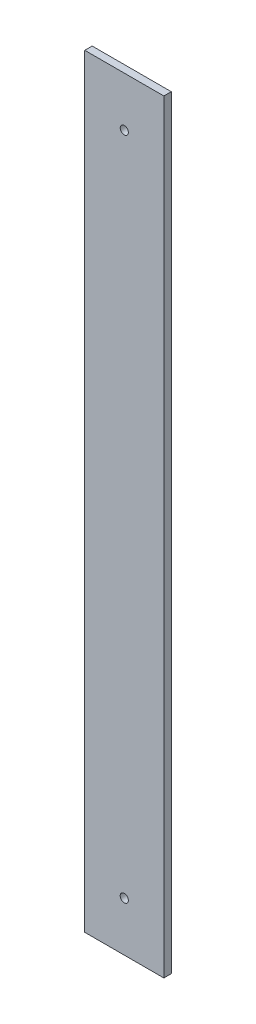
ISO-10303-21;
HEADER;
FILE_DESCRIPTION(('STEP AP214'),'2;1');
FILE_NAME('part.step','',(''),(''),'','','');
FILE_SCHEMA(('AUTOMOTIVE_DESIGN { 1 0 10303 214 1 1 1 1 }'));
ENDSEC;
DATA;
#1=APPLICATION_CONTEXT('core data for automotive mechanical design processes');
#2=APPLICATION_PROTOCOL_DEFINITION('international standard','automotive_design',2000,#1);
#3=PRODUCT_CONTEXT('',#1,'mechanical');
#4=PRODUCT('Part','Part','',(#3));
#5=PRODUCT_RELATED_PRODUCT_CATEGORY('part','',(#4));
#6=PRODUCT_DEFINITION_FORMATION('','',#4);
#7=PRODUCT_DEFINITION_CONTEXT('part definition',#1,'design');
#8=PRODUCT_DEFINITION('design','',#6,#7);
#9=PRODUCT_DEFINITION_SHAPE('','',#8);
#10=(LENGTH_UNIT() NAMED_UNIT(*) SI_UNIT(.MILLI.,.METRE.));
#11=(NAMED_UNIT(*) PLANE_ANGLE_UNIT() SI_UNIT($,.RADIAN.));
#12=(NAMED_UNIT(*) SI_UNIT($,.STERADIAN.) SOLID_ANGLE_UNIT());
#13=UNCERTAINTY_MEASURE_WITH_UNIT(LENGTH_MEASURE(1.E-05),#10,'distance_accuracy_value','');
#14=(GEOMETRIC_REPRESENTATION_CONTEXT(3) GLOBAL_UNCERTAINTY_ASSIGNED_CONTEXT((#13)) GLOBAL_UNIT_ASSIGNED_CONTEXT((#10,
#11,#12)) REPRESENTATION_CONTEXT('',''));
#15=CARTESIAN_POINT('',(0.,0.,0.));
#16=DIRECTION('',(0.,0.,1.));
#17=DIRECTION('',(1.,0.,0.));
#18=AXIS2_PLACEMENT_3D('',#15,#16,#17);
#19=CARTESIAN_POINT('',(0.,0.,3.));
#20=DIRECTION('',(1.,0.,0.));
#21=DIRECTION('',(0.,0.,-1.));
#22=AXIS2_PLACEMENT_3D('',#19,#20,#21);
#23=PLANE('',#22);
#24=DIRECTION('',(0.,-1.,0.));
#25=VECTOR('',#24,1.);
#26=CARTESIAN_POINT('',(0.,0.,0.));
#27=LINE('',#26,#25);
#28=CARTESIAN_POINT('',(0.,309.,0.));
#29=VERTEX_POINT('',#28);
#30=CARTESIAN_POINT('',(0.,0.,0.));
#31=VERTEX_POINT('',#30);
#32=EDGE_CURVE('E97',#29,#31,#27,.T.);
#33=ORIENTED_EDGE('',*,*,#32,.T.);
#34=DIRECTION('',(0.,0.,-1.));
#35=VECTOR('',#34,1.);
#36=CARTESIAN_POINT('',(0.,0.,3.));
#37=LINE('',#36,#35);
#38=CARTESIAN_POINT('',(0.,0.,3.));
#39=VERTEX_POINT('',#38);
#40=EDGE_CURVE('E11',#39,#31,#37,.T.);
#41=ORIENTED_EDGE('',*,*,#40,.F.);
#42=DIRECTION('',(0.,-1.,0.));
#43=VECTOR('',#42,1.);
#44=CARTESIAN_POINT('',(0.,0.,3.));
#45=LINE('',#44,#43);
#46=CARTESIAN_POINT('',(0.,309.,3.));
#47=VERTEX_POINT('',#46);
#48=EDGE_CURVE('E85',#47,#39,#45,.T.);
#49=ORIENTED_EDGE('',*,*,#48,.F.);
#50=DIRECTION('',(0.,0.,-1.));
#51=VECTOR('',#50,1.);
#52=CARTESIAN_POINT('',(0.,309.,3.));
#53=LINE('',#52,#51);
#54=EDGE_CURVE('E93',#47,#29,#53,.T.);
#55=ORIENTED_EDGE('',*,*,#54,.T.);
#56=EDGE_LOOP('',(#33,#41,#49,#55));
#57=FACE_BOUND('',#56,.T.);
#58=ADVANCED_FACE('F34',(#57),#23,.F.);
#59=CARTESIAN_POINT('',(0.,0.,3.));
#60=DIRECTION('',(0.,1.,0.));
#61=DIRECTION('',(0.,0.,1.));
#62=AXIS2_PLACEMENT_3D('',#59,#60,#61);
#63=PLANE('',#62);
#64=DIRECTION('',(1.,0.,0.));
#65=VECTOR('',#64,1.);
#66=CARTESIAN_POINT('',(0.,0.,0.));
#67=LINE('',#66,#65);
#68=CARTESIAN_POINT('',(32.,0.,0.));
#69=VERTEX_POINT('',#68);
#70=EDGE_CURVE('E89',#31,#69,#67,.T.);
#71=ORIENTED_EDGE('',*,*,#70,.T.);
#72=DIRECTION('',(0.,0.,-1.));
#73=VECTOR('',#72,1.);
#74=CARTESIAN_POINT('',(32.,0.,3.));
#75=LINE('',#74,#73);
#76=CARTESIAN_POINT('',(32.,0.,3.));
#77=VERTEX_POINT('',#76);
#78=EDGE_CURVE('E42',#77,#69,#75,.T.);
#79=ORIENTED_EDGE('',*,*,#78,.F.);
#80=DIRECTION('',(1.,0.,0.));
#81=VECTOR('',#80,1.);
#82=CARTESIAN_POINT('',(0.,0.,3.));
#83=LINE('',#82,#81);
#84=EDGE_CURVE('E80',#39,#77,#83,.T.);
#85=ORIENTED_EDGE('',*,*,#84,.F.);
#86=ORIENTED_EDGE('',*,*,#40,.T.);
#87=EDGE_LOOP('',(#71,#79,#85,#86));
#88=FACE_BOUND('',#87,.T.);
#89=ADVANCED_FACE('F88',(#88),#63,.F.);
#90=CARTESIAN_POINT('',(32.,0.,3.));
#91=DIRECTION('',(-1.,0.,0.));
#92=DIRECTION('',(0.,0.,1.));
#93=AXIS2_PLACEMENT_3D('',#90,#91,#92);
#94=PLANE('',#93);
#95=DIRECTION('',(0.,1.,0.));
#96=VECTOR('',#95,1.);
#97=CARTESIAN_POINT('',(32.,0.,0.));
#98=LINE('',#97,#96);
#99=CARTESIAN_POINT('',(32.,309.,0.));
#100=VERTEX_POINT('',#99);
#101=EDGE_CURVE('E67',#69,#100,#98,.T.);
#102=ORIENTED_EDGE('',*,*,#101,.T.);
#103=DIRECTION('',(0.,0.,-1.));
#104=VECTOR('',#103,1.);
#105=CARTESIAN_POINT('',(32.,309.,3.));
#106=LINE('',#105,#104);
#107=CARTESIAN_POINT('',(32.,309.,3.));
#108=VERTEX_POINT('',#107);
#109=EDGE_CURVE('E90',#108,#100,#106,.T.);
#110=ORIENTED_EDGE('',*,*,#109,.F.);
#111=DIRECTION('',(0.,1.,0.));
#112=VECTOR('',#111,1.);
#113=CARTESIAN_POINT('',(32.,0.,3.));
#114=LINE('',#113,#112);
#115=EDGE_CURVE('E83',#77,#108,#114,.T.);
#116=ORIENTED_EDGE('',*,*,#115,.F.);
#117=ORIENTED_EDGE('',*,*,#78,.T.);
#118=EDGE_LOOP('',(#102,#110,#116,#117));
#119=FACE_BOUND('',#118,.T.);
#120=ADVANCED_FACE('F91',(#119),#94,.F.);
#121=CARTESIAN_POINT('',(0.,309.,3.));
#122=DIRECTION('',(0.,-1.,0.));
#123=DIRECTION('',(0.,0.,-1.));
#124=AXIS2_PLACEMENT_3D('',#121,#122,#123);
#125=PLANE('',#124);
#126=DIRECTION('',(-1.,0.,0.));
#127=VECTOR('',#126,1.);
#128=CARTESIAN_POINT('',(0.,309.,0.));
#129=LINE('',#128,#127);
#130=EDGE_CURVE('E73',#100,#29,#129,.T.);
#131=ORIENTED_EDGE('',*,*,#130,.T.);
#132=ORIENTED_EDGE('',*,*,#54,.F.);
#133=DIRECTION('',(-1.,0.,0.));
#134=VECTOR('',#133,1.);
#135=CARTESIAN_POINT('',(0.,309.,3.));
#136=LINE('',#135,#134);
#137=EDGE_CURVE('E50',#108,#47,#136,.T.);
#138=ORIENTED_EDGE('',*,*,#137,.F.);
#139=ORIENTED_EDGE('',*,*,#109,.T.);
#140=EDGE_LOOP('',(#131,#132,#138,#139));
#141=FACE_BOUND('',#140,.T.);
#142=ADVANCED_FACE('F105',(#141),#125,.F.);
#143=CARTESIAN_POINT('',(0.,0.,3.));
#144=DIRECTION('',(0.,0.,-1.));
#145=DIRECTION('',(-1.,0.,0.));
#146=AXIS2_PLACEMENT_3D('',#143,#144,#145);
#147=PLANE('',#146);
#148=CARTESIAN_POINT('',(16.,289.,3.));
#149=DIRECTION('',(0.,0.,1.));
#150=DIRECTION('',(1.,0.,0.));
#151=AXIS2_PLACEMENT_3D('',#148,#149,#150);
#152=CIRCLE('',#151,1.65000000000001);
#153=CARTESIAN_POINT('',(17.65,289.,3.));
#154=VERTEX_POINT('',#153);
#155=EDGE_CURVE('E117',#154,#154,#152,.T.);
#156=ORIENTED_EDGE('',*,*,#155,.F.);
#157=EDGE_LOOP('',(#156));
#158=FACE_BOUND('',#157,.T.);
#159=CARTESIAN_POINT('',(16.,20.,3.));
#160=DIRECTION('',(0.,0.,1.));
#161=DIRECTION('',(-1.,0.,0.));
#162=AXIS2_PLACEMENT_3D('',#159,#160,#161);
#163=CIRCLE('',#162,1.65000000000001);
#164=CARTESIAN_POINT('',(14.35,20.,3.));
#165=VERTEX_POINT('',#164);
#166=EDGE_CURVE('E111',#165,#165,#163,.T.);
#167=ORIENTED_EDGE('',*,*,#166,.F.);
#168=EDGE_LOOP('',(#167));
#169=FACE_BOUND('',#168,.T.);
#170=ORIENTED_EDGE('',*,*,#48,.T.);
#171=ORIENTED_EDGE('',*,*,#84,.T.);
#172=ORIENTED_EDGE('',*,*,#115,.T.);
#173=ORIENTED_EDGE('',*,*,#137,.T.);
#174=EDGE_LOOP('',(#170,#171,#172,#173));
#175=FACE_BOUND('',#174,.T.);
#176=ADVANCED_FACE('F81',(#158,#169,#175),#147,.F.);
#177=CARTESIAN_POINT('',(0.,0.,0.));
#178=DIRECTION('',(0.,0.,-1.));
#179=DIRECTION('',(-1.,0.,0.));
#180=AXIS2_PLACEMENT_3D('',#177,#178,#179);
#181=PLANE('',#180);
#182=CARTESIAN_POINT('',(16.,289.,0.));
#183=DIRECTION('',(0.,0.,1.));
#184=DIRECTION('',(1.,0.,0.));
#185=AXIS2_PLACEMENT_3D('',#182,#183,#184);
#186=CIRCLE('',#185,1.65000000000001);
#187=CARTESIAN_POINT('',(17.65,289.,0.));
#188=VERTEX_POINT('',#187);
#189=EDGE_CURVE('E100',#188,#188,#186,.T.);
#190=ORIENTED_EDGE('',*,*,#189,.T.);
#191=EDGE_LOOP('',(#190));
#192=FACE_BOUND('',#191,.T.);
#193=CARTESIAN_POINT('',(16.,20.,0.));
#194=DIRECTION('',(0.,0.,1.));
#195=DIRECTION('',(-1.,0.,0.));
#196=AXIS2_PLACEMENT_3D('',#193,#194,#195);
#197=CIRCLE('',#196,1.65000000000001);
#198=CARTESIAN_POINT('',(14.35,20.,0.));
#199=VERTEX_POINT('',#198);
#200=EDGE_CURVE('E114',#199,#199,#197,.T.);
#201=ORIENTED_EDGE('',*,*,#200,.T.);
#202=EDGE_LOOP('',(#201));
#203=FACE_BOUND('',#202,.T.);
#204=ORIENTED_EDGE('',*,*,#32,.F.);
#205=ORIENTED_EDGE('',*,*,#130,.F.);
#206=ORIENTED_EDGE('',*,*,#101,.F.);
#207=ORIENTED_EDGE('',*,*,#70,.F.);
#208=EDGE_LOOP('',(#204,#205,#206,#207));
#209=FACE_BOUND('',#208,.T.);
#210=ADVANCED_FACE('F108',(#192,#203,#209),#181,.T.);
#211=CARTESIAN_POINT('',(16.,20.,0.));
#212=DIRECTION('',(0.,0.,1.));
#213=DIRECTION('',(1.,0.,0.));
#214=AXIS2_PLACEMENT_3D('',#211,#212,#213);
#215=CYLINDRICAL_SURFACE('',#214,1.65000000000001);
#216=ORIENTED_EDGE('',*,*,#200,.F.);
#217=EDGE_LOOP('',(#216));
#218=FACE_BOUND('',#217,.T.);
#219=ORIENTED_EDGE('',*,*,#166,.T.);
#220=EDGE_LOOP('',(#219));
#221=FACE_BOUND('',#220,.T.);
#222=ADVANCED_FACE('F128',(#218,#221),#215,.F.);
#223=CARTESIAN_POINT('',(16.,289.,0.));
#224=DIRECTION('',(0.,0.,1.));
#225=DIRECTION('',(1.,0.,0.));
#226=AXIS2_PLACEMENT_3D('',#223,#224,#225);
#227=CYLINDRICAL_SURFACE('',#226,1.65000000000001);
#228=ORIENTED_EDGE('',*,*,#189,.F.);
#229=EDGE_LOOP('',(#228));
#230=FACE_BOUND('',#229,.T.);
#231=ORIENTED_EDGE('',*,*,#155,.T.);
#232=EDGE_LOOP('',(#231));
#233=FACE_BOUND('',#232,.T.);
#234=ADVANCED_FACE('F125',(#230,#233),#227,.F.);
#235=CLOSED_SHELL('',(#58,#89,#120,#142,#176,#210,#222,#234));
#236=MANIFOLD_SOLID_BREP('B2',#235);
#237=ADVANCED_BREP_SHAPE_REPRESENTATION('',(#18,#236),#14);
#238=SHAPE_DEFINITION_REPRESENTATION(#9,#237);
ENDSEC;
END-ISO-10303-21;
